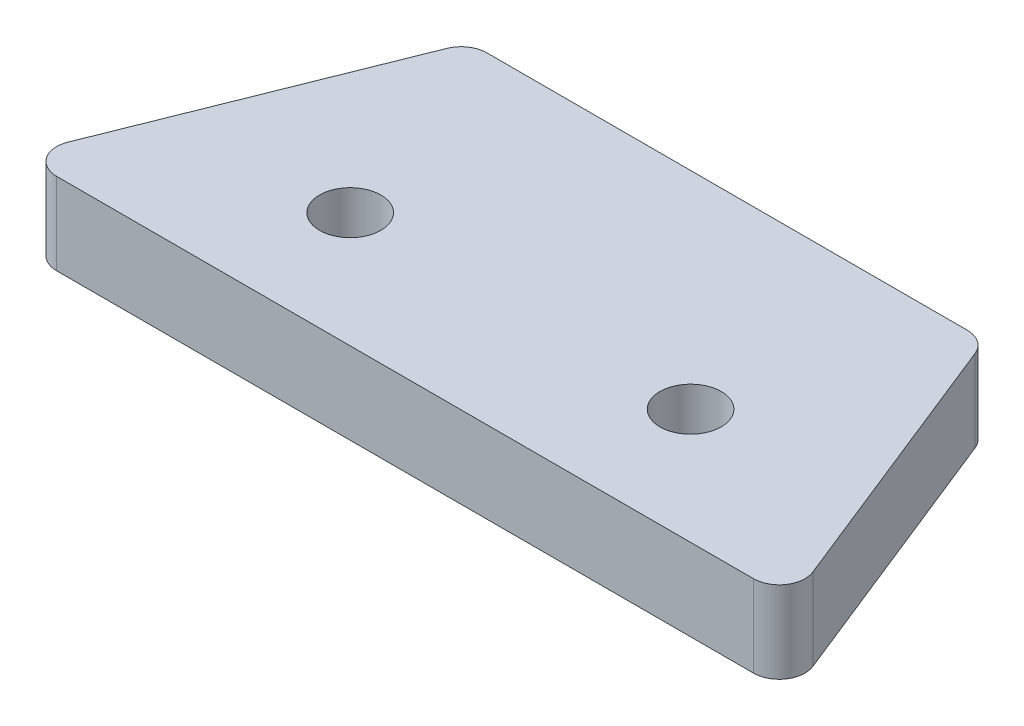
ISO-10303-21;
HEADER;
FILE_DESCRIPTION(('STEP AP214'),'2;1');
FILE_NAME('part.step','',(''),(''),'','','');
FILE_SCHEMA(('AUTOMOTIVE_DESIGN { 1 0 10303 214 1 1 1 1 }'));
ENDSEC;
DATA;
#1=APPLICATION_CONTEXT('core data for automotive mechanical design processes');
#2=APPLICATION_PROTOCOL_DEFINITION('international standard','automotive_design',2000,#1);
#3=PRODUCT_CONTEXT('',#1,'mechanical');
#4=PRODUCT('Part','Part','',(#3));
#5=PRODUCT_RELATED_PRODUCT_CATEGORY('part','',(#4));
#6=PRODUCT_DEFINITION_FORMATION('','',#4);
#7=PRODUCT_DEFINITION_CONTEXT('part definition',#1,'design');
#8=PRODUCT_DEFINITION('design','',#6,#7);
#9=PRODUCT_DEFINITION_SHAPE('','',#8);
#10=(LENGTH_UNIT() NAMED_UNIT(*) SI_UNIT(.MILLI.,.METRE.));
#11=(NAMED_UNIT(*) PLANE_ANGLE_UNIT() SI_UNIT($,.RADIAN.));
#12=(NAMED_UNIT(*) SI_UNIT($,.STERADIAN.) SOLID_ANGLE_UNIT());
#13=UNCERTAINTY_MEASURE_WITH_UNIT(LENGTH_MEASURE(1.E-05),#10,'distance_accuracy_value','');
#14=(GEOMETRIC_REPRESENTATION_CONTEXT(3) GLOBAL_UNCERTAINTY_ASSIGNED_CONTEXT((#13)) GLOBAL_UNIT_ASSIGNED_CONTEXT((#10,
#11,#12)) REPRESENTATION_CONTEXT('',''));
#15=CARTESIAN_POINT('',(0.,0.,0.));
#16=DIRECTION('',(0.,0.,1.));
#17=DIRECTION('',(1.,0.,0.));
#18=AXIS2_PLACEMENT_3D('',#15,#16,#17);
#19=CARTESIAN_POINT('',(0.,6.35,0.));
#20=DIRECTION('',(0.,-1.,0.));
#21=DIRECTION('',(0.,0.,-1.));
#22=AXIS2_PLACEMENT_3D('',#19,#20,#21);
#23=PLANE('',#22);
#24=DIRECTION('',(1.,0.,0.));
#25=VECTOR('',#24,1.);
#26=CARTESIAN_POINT('',(30.,6.35,12.5));
#27=LINE('',#26,#25);
#28=CARTESIAN_POINT('',(-27.0459340771462,6.35,12.5));
#29=VERTEX_POINT('',#28);
#30=CARTESIAN_POINT('',(27.0459340771462,6.35,12.5));
#31=VERTEX_POINT('',#30);
#32=EDGE_CURVE('E171',#29,#31,#27,.T.);
#33=ORIENTED_EDGE('',*,*,#32,.T.);
#34=CARTESIAN_POINT('',(27.0459340771462,6.35,10.5));
#35=DIRECTION('',(0.,-1.,0.));
#36=DIRECTION('',(0.,0.,-1.));
#37=AXIS2_PLACEMENT_3D('',#34,#35,#36);
#38=CIRCLE('',#37,2.);
#39=CARTESIAN_POINT('',(28.9028874589167,6.35,9.75721864729176));
#40=VERTEX_POINT('',#39);
#41=EDGE_CURVE('E152',#31,#40,#38,.F.);
#42=ORIENTED_EDGE('',*,*,#41,.T.);
#43=DIRECTION('',(-0.371390676354102,0.,-0.92847669088526));
#44=VECTOR('',#43,1.);
#45=CARTESIAN_POINT('',(20.,6.35,-12.5000000000001));
#46=LINE('',#45,#44);
#47=CARTESIAN_POINT('',(20.5028874589167,6.35,-11.2427813527083));
#48=VERTEX_POINT('',#47);
#49=EDGE_CURVE('E122',#40,#48,#46,.T.);
#50=ORIENTED_EDGE('',*,*,#49,.T.);
#51=CARTESIAN_POINT('',(18.6459340771462,6.35,-10.5000000000001));
#52=DIRECTION('',(0.,-1.,0.));
#53=DIRECTION('',(0.,0.,-1.));
#54=AXIS2_PLACEMENT_3D('',#51,#52,#53);
#55=CIRCLE('',#54,2.);
#56=CARTESIAN_POINT('',(18.6459340771462,6.35,-12.5000000000001));
#57=VERTEX_POINT('',#56);
#58=EDGE_CURVE('E58',#48,#57,#55,.F.);
#59=ORIENTED_EDGE('',*,*,#58,.T.);
#60=DIRECTION('',(-1.,0.,0.));
#61=VECTOR('',#60,1.);
#62=CARTESIAN_POINT('',(-20.,6.35,-12.5000000000001));
#63=LINE('',#62,#61);
#64=CARTESIAN_POINT('',(-18.6459340771462,6.35,-12.5000000000001));
#65=VERTEX_POINT('',#64);
#66=EDGE_CURVE('E138',#57,#65,#63,.T.);
#67=ORIENTED_EDGE('',*,*,#66,.T.);
#68=CARTESIAN_POINT('',(-18.6459340771462,6.35,-10.5));
#69=DIRECTION('',(0.,-1.,0.));
#70=DIRECTION('',(0.,0.,-1.));
#71=AXIS2_PLACEMENT_3D('',#68,#69,#70);
#72=CIRCLE('',#71,2.);
#73=CARTESIAN_POINT('',(-20.5028874589167,6.35,-11.2427813527083));
#74=VERTEX_POINT('',#73);
#75=EDGE_CURVE('E149',#65,#74,#72,.F.);
#76=ORIENTED_EDGE('',*,*,#75,.T.);
#77=DIRECTION('',(-0.371390676354103,0.,0.92847669088526));
#78=VECTOR('',#77,1.);
#79=CARTESIAN_POINT('',(-30.,6.35,12.5));
#80=LINE('',#79,#78);
#81=CARTESIAN_POINT('',(-28.9028874589167,6.35,9.75721864729176));
#82=VERTEX_POINT('',#81);
#83=EDGE_CURVE('E132',#74,#82,#80,.T.);
#84=ORIENTED_EDGE('',*,*,#83,.T.);
#85=CARTESIAN_POINT('',(-27.0459340771462,6.35,10.5));
#86=DIRECTION('',(0.,-1.,0.));
#87=DIRECTION('',(0.,0.,-1.));
#88=AXIS2_PLACEMENT_3D('',#85,#86,#87);
#89=CIRCLE('',#88,2.);
#90=EDGE_CURVE('E147',#82,#29,#89,.F.);
#91=ORIENTED_EDGE('',*,*,#90,.T.);
#92=EDGE_LOOP('',(#33,#42,#50,#59,#67,#76,#84,#91));
#93=FACE_BOUND('',#92,.T.);
#94=CARTESIAN_POINT('',(-13.2098102352129,6.35,3.54905117606474));
#95=DIRECTION('',(0.,1.,0.));
#96=DIRECTION('',(0.,0.,1.));
#97=AXIS2_PLACEMENT_3D('',#94,#95,#96);
#98=CIRCLE('',#97,2.38);
#99=CARTESIAN_POINT('',(-13.2098102352129,6.35,5.92905117606474));
#100=VERTEX_POINT('',#99);
#101=EDGE_CURVE('E176',#100,#100,#98,.T.);
#102=ORIENTED_EDGE('',*,*,#101,.F.);
#103=EDGE_LOOP('',(#102));
#104=FACE_BOUND('',#103,.T.);
#105=CARTESIAN_POINT('',(13.2098102352129,6.35,3.54905117606474));
#106=DIRECTION('',(0.,1.,0.));
#107=DIRECTION('',(0.,0.,1.));
#108=AXIS2_PLACEMENT_3D('',#105,#106,#107);
#109=CIRCLE('',#108,2.38);
#110=CARTESIAN_POINT('',(13.2098102352129,6.35,5.92905117606474));
#111=VERTEX_POINT('',#110);
#112=EDGE_CURVE('E185',#111,#111,#109,.T.);
#113=ORIENTED_EDGE('',*,*,#112,.F.);
#114=EDGE_LOOP('',(#113));
#115=FACE_BOUND('',#114,.T.);
#116=ADVANCED_FACE('F36',(#93,#104,#115),#23,.F.);
#117=CARTESIAN_POINT('',(0.,0.,0.));
#118=DIRECTION('',(0.,-1.,0.));
#119=DIRECTION('',(0.,0.,-1.));
#120=AXIS2_PLACEMENT_3D('',#117,#118,#119);
#121=PLANE('',#120);
#122=CARTESIAN_POINT('',(-13.2098102352129,0.,3.54905117606474));
#123=DIRECTION('',(0.,1.,0.));
#124=DIRECTION('',(0.,0.,1.));
#125=AXIS2_PLACEMENT_3D('',#122,#123,#124);
#126=CIRCLE('',#125,2.38);
#127=CARTESIAN_POINT('',(-13.2098102352129,0.,5.92905117606474));
#128=VERTEX_POINT('',#127);
#129=EDGE_CURVE('E178',#128,#128,#126,.T.);
#130=ORIENTED_EDGE('',*,*,#129,.T.);
#131=EDGE_LOOP('',(#130));
#132=FACE_BOUND('',#131,.T.);
#133=DIRECTION('',(-0.371390676354102,0.,-0.92847669088526));
#134=VECTOR('',#133,1.);
#135=CARTESIAN_POINT('',(20.,0.,-12.5000000000001));
#136=LINE('',#135,#134);
#137=CARTESIAN_POINT('',(28.9028874589167,0.,9.75721864729176));
#138=VERTEX_POINT('',#137);
#139=CARTESIAN_POINT('',(20.5028874589167,0.,-11.2427813527083));
#140=VERTEX_POINT('',#139);
#141=EDGE_CURVE('E120',#138,#140,#136,.T.);
#142=ORIENTED_EDGE('',*,*,#141,.F.);
#143=CARTESIAN_POINT('',(27.0459340771462,0.,10.5));
#144=DIRECTION('',(0.,-1.,0.));
#145=DIRECTION('',(0.,0.,-1.));
#146=AXIS2_PLACEMENT_3D('',#143,#144,#145);
#147=CIRCLE('',#146,2.);
#148=CARTESIAN_POINT('',(27.0459340771462,0.,12.5));
#149=VERTEX_POINT('',#148);
#150=EDGE_CURVE('E103',#138,#149,#147,.T.);
#151=ORIENTED_EDGE('',*,*,#150,.T.);
#152=DIRECTION('',(1.,0.,0.));
#153=VECTOR('',#152,1.);
#154=CARTESIAN_POINT('',(30.,0.,12.5));
#155=LINE('',#154,#153);
#156=CARTESIAN_POINT('',(-27.0459340771462,0.,12.5));
#157=VERTEX_POINT('',#156);
#158=EDGE_CURVE('E130',#157,#149,#155,.T.);
#159=ORIENTED_EDGE('',*,*,#158,.F.);
#160=CARTESIAN_POINT('',(-27.0459340771462,0.,10.5));
#161=DIRECTION('',(0.,-1.,0.));
#162=DIRECTION('',(0.,0.,-1.));
#163=AXIS2_PLACEMENT_3D('',#160,#161,#162);
#164=CIRCLE('',#163,2.);
#165=CARTESIAN_POINT('',(-28.9028874589167,0.,9.75721864729176));
#166=VERTEX_POINT('',#165);
#167=EDGE_CURVE('E123',#157,#166,#164,.T.);
#168=ORIENTED_EDGE('',*,*,#167,.T.);
#169=DIRECTION('',(-0.371390676354103,0.,0.92847669088526));
#170=VECTOR('',#169,1.);
#171=CARTESIAN_POINT('',(-30.,0.,12.5));
#172=LINE('',#171,#170);
#173=CARTESIAN_POINT('',(-20.5028874589167,0.,-11.2427813527083));
#174=VERTEX_POINT('',#173);
#175=EDGE_CURVE('E134',#174,#166,#172,.T.);
#176=ORIENTED_EDGE('',*,*,#175,.F.);
#177=CARTESIAN_POINT('',(-18.6459340771462,0.,-10.5));
#178=DIRECTION('',(0.,-1.,0.));
#179=DIRECTION('',(0.,0.,-1.));
#180=AXIS2_PLACEMENT_3D('',#177,#178,#179);
#181=CIRCLE('',#180,2.);
#182=CARTESIAN_POINT('',(-18.6459340771462,0.,-12.5000000000001));
#183=VERTEX_POINT('',#182);
#184=EDGE_CURVE('E141',#174,#183,#181,.T.);
#185=ORIENTED_EDGE('',*,*,#184,.T.);
#186=DIRECTION('',(-1.,0.,0.));
#187=VECTOR('',#186,1.);
#188=CARTESIAN_POINT('',(-20.,0.,-12.5000000000001));
#189=LINE('',#188,#187);
#190=CARTESIAN_POINT('',(18.6459340771462,0.,-12.5000000000001));
#191=VERTEX_POINT('',#190);
#192=EDGE_CURVE('E129',#191,#183,#189,.T.);
#193=ORIENTED_EDGE('',*,*,#192,.F.);
#194=CARTESIAN_POINT('',(18.6459340771462,0.,-10.5000000000001));
#195=DIRECTION('',(0.,-1.,0.));
#196=DIRECTION('',(0.,0.,-1.));
#197=AXIS2_PLACEMENT_3D('',#194,#195,#196);
#198=CIRCLE('',#197,2.);
#199=EDGE_CURVE('E114',#191,#140,#198,.T.);
#200=ORIENTED_EDGE('',*,*,#199,.T.);
#201=EDGE_LOOP('',(#142,#151,#159,#168,#176,#185,#193,#200));
#202=FACE_BOUND('',#201,.T.);
#203=CARTESIAN_POINT('',(13.2098102352129,0.,3.54905117606474));
#204=DIRECTION('',(0.,1.,0.));
#205=DIRECTION('',(0.,0.,1.));
#206=AXIS2_PLACEMENT_3D('',#203,#204,#205);
#207=CIRCLE('',#206,2.38);
#208=CARTESIAN_POINT('',(13.2098102352129,0.,5.92905117606474));
#209=VERTEX_POINT('',#208);
#210=EDGE_CURVE('E187',#209,#209,#207,.T.);
#211=ORIENTED_EDGE('',*,*,#210,.T.);
#212=EDGE_LOOP('',(#211));
#213=FACE_BOUND('',#212,.T.);
#214=ADVANCED_FACE('F126',(#132,#202,#213),#121,.T.);
#215=CARTESIAN_POINT('',(-30.,6.35,12.5));
#216=DIRECTION('',(0.92847669088526,0.,0.371390676354103));
#217=DIRECTION('',(0.371390676354103,0.,-0.92847669088526));
#218=AXIS2_PLACEMENT_3D('',#215,#216,#217);
#219=PLANE('',#218);
#220=ORIENTED_EDGE('',*,*,#83,.F.);
#221=DIRECTION('',(0.,-1.,0.));
#222=VECTOR('',#221,1.);
#223=CARTESIAN_POINT('',(-20.5028874589167,6.35,-11.2427813527082));
#224=LINE('',#223,#222);
#225=EDGE_CURVE('E11',#74,#174,#224,.T.);
#226=ORIENTED_EDGE('',*,*,#225,.T.);
#227=ORIENTED_EDGE('',*,*,#175,.T.);
#228=DIRECTION('',(0.,-1.,0.));
#229=VECTOR('',#228,1.);
#230=CARTESIAN_POINT('',(-28.9028874589167,6.35,9.75721864729176));
#231=LINE('',#230,#229);
#232=EDGE_CURVE('E44',#166,#82,#231,.F.);
#233=ORIENTED_EDGE('',*,*,#232,.T.);
#234=EDGE_LOOP('',(#220,#226,#227,#233));
#235=FACE_BOUND('',#234,.T.);
#236=ADVANCED_FACE('F162',(#235),#219,.F.);
#237=CARTESIAN_POINT('',(30.,6.35,12.5));
#238=DIRECTION('',(0.,0.,-1.));
#239=DIRECTION('',(-1.,0.,0.));
#240=AXIS2_PLACEMENT_3D('',#237,#238,#239);
#241=PLANE('',#240);
#242=ORIENTED_EDGE('',*,*,#158,.T.);
#243=DIRECTION('',(0.,-1.,0.));
#244=VECTOR('',#243,1.);
#245=CARTESIAN_POINT('',(27.0459340771462,6.35,12.5));
#246=LINE('',#245,#244);
#247=EDGE_CURVE('E108',#149,#31,#246,.F.);
#248=ORIENTED_EDGE('',*,*,#247,.T.);
#249=ORIENTED_EDGE('',*,*,#32,.F.);
#250=DIRECTION('',(0.,-1.,0.));
#251=VECTOR('',#250,1.);
#252=CARTESIAN_POINT('',(-27.0459340771462,6.35,12.5));
#253=LINE('',#252,#251);
#254=EDGE_CURVE('E113',#29,#157,#253,.T.);
#255=ORIENTED_EDGE('',*,*,#254,.T.);
#256=EDGE_LOOP('',(#242,#248,#249,#255));
#257=FACE_BOUND('',#256,.T.);
#258=ADVANCED_FACE('F175',(#257),#241,.F.);
#259=CARTESIAN_POINT('',(20.,6.35,-12.5000000000001));
#260=DIRECTION('',(-0.92847669088526,0.,0.371390676354102));
#261=DIRECTION('',(0.371390676354102,0.,0.92847669088526));
#262=AXIS2_PLACEMENT_3D('',#259,#260,#261);
#263=PLANE('',#262);
#264=ORIENTED_EDGE('',*,*,#49,.F.);
#265=DIRECTION('',(0.,-1.,0.));
#266=VECTOR('',#265,1.);
#267=CARTESIAN_POINT('',(28.9028874589167,6.35,9.75721864729177));
#268=LINE('',#267,#266);
#269=EDGE_CURVE('E107',#40,#138,#268,.T.);
#270=ORIENTED_EDGE('',*,*,#269,.T.);
#271=ORIENTED_EDGE('',*,*,#141,.T.);
#272=DIRECTION('',(0.,-1.,0.));
#273=VECTOR('',#272,1.);
#274=CARTESIAN_POINT('',(20.5028874589167,6.35,-11.2427813527083));
#275=LINE('',#274,#273);
#276=EDGE_CURVE('E124',#140,#48,#275,.F.);
#277=ORIENTED_EDGE('',*,*,#276,.T.);
#278=EDGE_LOOP('',(#264,#270,#271,#277));
#279=FACE_BOUND('',#278,.T.);
#280=ADVANCED_FACE('F119',(#279),#263,.F.);
#281=CARTESIAN_POINT('',(-20.,6.35,-12.5000000000001));
#282=DIRECTION('',(0.,0.,1.));
#283=DIRECTION('',(1.,0.,0.));
#284=AXIS2_PLACEMENT_3D('',#281,#282,#283);
#285=PLANE('',#284);
#286=ORIENTED_EDGE('',*,*,#66,.F.);
#287=DIRECTION('',(0.,-1.,0.));
#288=VECTOR('',#287,1.);
#289=CARTESIAN_POINT('',(18.6459340771462,6.35,-12.5000000000001));
#290=LINE('',#289,#288);
#291=EDGE_CURVE('E155',#57,#191,#290,.T.);
#292=ORIENTED_EDGE('',*,*,#291,.T.);
#293=ORIENTED_EDGE('',*,*,#192,.T.);
#294=DIRECTION('',(0.,-1.,0.));
#295=VECTOR('',#294,1.);
#296=CARTESIAN_POINT('',(-18.6459340771462,6.35,-12.5000000000001));
#297=LINE('',#296,#295);
#298=EDGE_CURVE('E51',#183,#65,#297,.F.);
#299=ORIENTED_EDGE('',*,*,#298,.T.);
#300=EDGE_LOOP('',(#286,#292,#293,#299));
#301=FACE_BOUND('',#300,.T.);
#302=ADVANCED_FACE('F207',(#301),#285,.F.);
#303=CARTESIAN_POINT('',(-13.2098102352129,6.35,3.54905117606474));
#304=DIRECTION('',(0.,-1.,0.));
#305=DIRECTION('',(0.,0.,-1.));
#306=AXIS2_PLACEMENT_3D('',#303,#304,#305);
#307=CYLINDRICAL_SURFACE('',#306,2.38);
#308=ORIENTED_EDGE('',*,*,#101,.T.);
#309=EDGE_LOOP('',(#308));
#310=FACE_BOUND('',#309,.T.);
#311=ORIENTED_EDGE('',*,*,#129,.F.);
#312=EDGE_LOOP('',(#311));
#313=FACE_BOUND('',#312,.T.);
#314=ADVANCED_FACE('F204',(#310,#313),#307,.F.);
#315=CARTESIAN_POINT('',(13.2098102352129,6.35,3.54905117606474));
#316=DIRECTION('',(0.,-1.,0.));
#317=DIRECTION('',(0.,0.,-1.));
#318=AXIS2_PLACEMENT_3D('',#315,#316,#317);
#319=CYLINDRICAL_SURFACE('',#318,2.38);
#320=ORIENTED_EDGE('',*,*,#112,.T.);
#321=EDGE_LOOP('',(#320));
#322=FACE_BOUND('',#321,.T.);
#323=ORIENTED_EDGE('',*,*,#210,.F.);
#324=EDGE_LOOP('',(#323));
#325=FACE_BOUND('',#324,.T.);
#326=ADVANCED_FACE('F193',(#322,#325),#319,.F.);
#327=CARTESIAN_POINT('',(27.0459340771462,6.35,10.5));
#328=DIRECTION('',(0.,-1.,0.));
#329=DIRECTION('',(0.,0.,-1.));
#330=AXIS2_PLACEMENT_3D('',#327,#328,#329);
#331=CYLINDRICAL_SURFACE('',#330,2.);
#332=ORIENTED_EDGE('',*,*,#41,.F.);
#333=ORIENTED_EDGE('',*,*,#247,.F.);
#334=ORIENTED_EDGE('',*,*,#150,.F.);
#335=ORIENTED_EDGE('',*,*,#269,.F.);
#336=EDGE_LOOP('',(#332,#333,#334,#335));
#337=FACE_BOUND('',#336,.T.);
#338=ADVANCED_FACE('F106',(#337),#331,.T.);
#339=CARTESIAN_POINT('',(18.6459340771462,6.35,-10.5000000000001));
#340=DIRECTION('',(0.,-1.,0.));
#341=DIRECTION('',(0.,0.,-1.));
#342=AXIS2_PLACEMENT_3D('',#339,#340,#341);
#343=CYLINDRICAL_SURFACE('',#342,2.);
#344=ORIENTED_EDGE('',*,*,#58,.F.);
#345=ORIENTED_EDGE('',*,*,#276,.F.);
#346=ORIENTED_EDGE('',*,*,#199,.F.);
#347=ORIENTED_EDGE('',*,*,#291,.F.);
#348=EDGE_LOOP('',(#344,#345,#346,#347));
#349=FACE_BOUND('',#348,.T.);
#350=ADVANCED_FACE('F218',(#349),#343,.T.);
#351=CARTESIAN_POINT('',(-18.6459340771462,6.35,-10.5));
#352=DIRECTION('',(0.,-1.,0.));
#353=DIRECTION('',(0.,0.,-1.));
#354=AXIS2_PLACEMENT_3D('',#351,#352,#353);
#355=CYLINDRICAL_SURFACE('',#354,2.);
#356=ORIENTED_EDGE('',*,*,#75,.F.);
#357=ORIENTED_EDGE('',*,*,#298,.F.);
#358=ORIENTED_EDGE('',*,*,#184,.F.);
#359=ORIENTED_EDGE('',*,*,#225,.F.);
#360=EDGE_LOOP('',(#356,#357,#358,#359));
#361=FACE_BOUND('',#360,.T.);
#362=ADVANCED_FACE('F220',(#361),#355,.T.);
#363=CARTESIAN_POINT('',(-27.0459340771462,6.35,10.5));
#364=DIRECTION('',(0.,-1.,0.));
#365=DIRECTION('',(0.,0.,-1.));
#366=AXIS2_PLACEMENT_3D('',#363,#364,#365);
#367=CYLINDRICAL_SURFACE('',#366,2.);
#368=ORIENTED_EDGE('',*,*,#90,.F.);
#369=ORIENTED_EDGE('',*,*,#232,.F.);
#370=ORIENTED_EDGE('',*,*,#167,.F.);
#371=ORIENTED_EDGE('',*,*,#254,.F.);
#372=EDGE_LOOP('',(#368,#369,#370,#371));
#373=FACE_BOUND('',#372,.T.);
#374=ADVANCED_FACE('F38',(#373),#367,.T.);
#375=CLOSED_SHELL('',(#116,#214,#236,#258,#280,#302,#314,#326,#338,#350,#362,#374));
#376=MANIFOLD_SOLID_BREP('B2',#375);
#377=ADVANCED_BREP_SHAPE_REPRESENTATION('',(#18,#376),#14);
#378=SHAPE_DEFINITION_REPRESENTATION(#9,#377);
ENDSEC;
END-ISO-10303-21;
